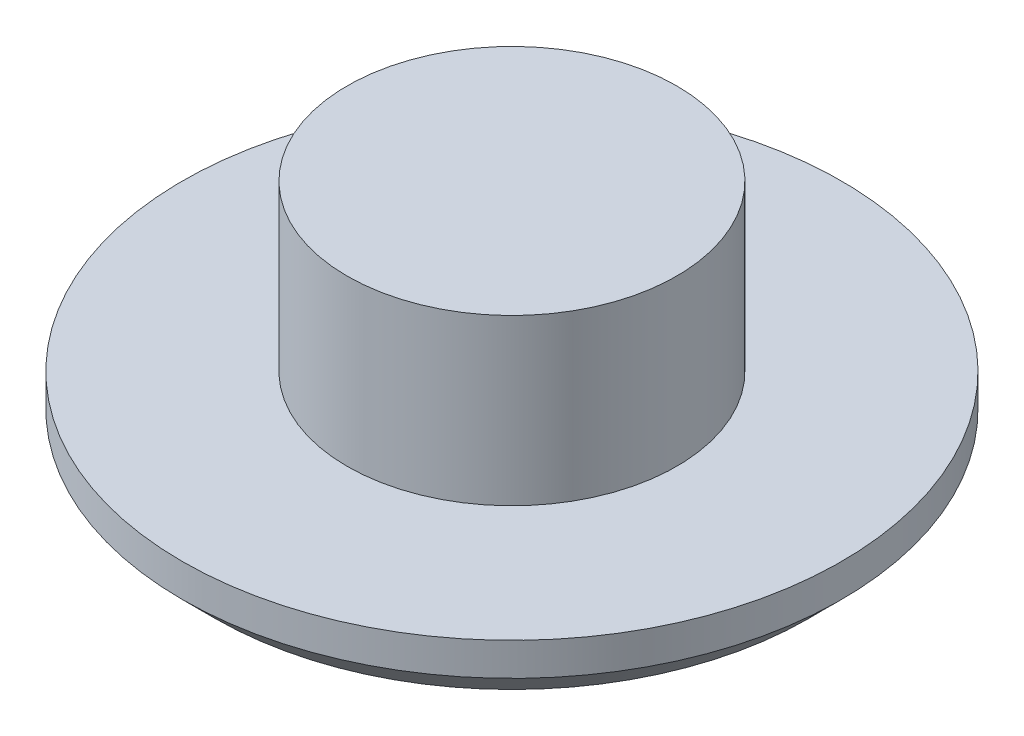
ISO-10303-21;
HEADER;
FILE_DESCRIPTION(('STEP AP214'),'2;1');
FILE_NAME('part.step','',(''),(''),'','','');
FILE_SCHEMA(('AUTOMOTIVE_DESIGN { 1 0 10303 214 1 1 1 1 }'));
ENDSEC;
DATA;
#1=APPLICATION_CONTEXT('core data for automotive mechanical design processes');
#2=APPLICATION_PROTOCOL_DEFINITION('international standard','automotive_design',2000,#1);
#3=PRODUCT_CONTEXT('',#1,'mechanical');
#4=PRODUCT('Part','Part','',(#3));
#5=PRODUCT_RELATED_PRODUCT_CATEGORY('part','',(#4));
#6=PRODUCT_DEFINITION_FORMATION('','',#4);
#7=PRODUCT_DEFINITION_CONTEXT('part definition',#1,'design');
#8=PRODUCT_DEFINITION('design','',#6,#7);
#9=PRODUCT_DEFINITION_SHAPE('','',#8);
#10=(LENGTH_UNIT() NAMED_UNIT(*) SI_UNIT(.MILLI.,.METRE.));
#11=(NAMED_UNIT(*) PLANE_ANGLE_UNIT() SI_UNIT($,.RADIAN.));
#12=(NAMED_UNIT(*) SI_UNIT($,.STERADIAN.) SOLID_ANGLE_UNIT());
#13=UNCERTAINTY_MEASURE_WITH_UNIT(LENGTH_MEASURE(1.E-05),#10,'distance_accuracy_value','');
#14=(GEOMETRIC_REPRESENTATION_CONTEXT(3) GLOBAL_UNCERTAINTY_ASSIGNED_CONTEXT((#13)) GLOBAL_UNIT_ASSIGNED_CONTEXT((#10,
#11,#12)) REPRESENTATION_CONTEXT('',''));
#15=CARTESIAN_POINT('',(0.,0.,0.));
#16=DIRECTION('',(0.,0.,1.));
#17=DIRECTION('',(1.,0.,0.));
#18=AXIS2_PLACEMENT_3D('',#15,#16,#17);
#19=CARTESIAN_POINT('',(0.,2.54,0.));
#20=DIRECTION('',(0.,-1.,0.));
#21=DIRECTION('',(0.,0.,-1.));
#22=AXIS2_PLACEMENT_3D('',#19,#20,#21);
#23=CYLINDRICAL_SURFACE('',#22,12.7);
#24=CARTESIAN_POINT('',(0.,1.27,0.));
#25=DIRECTION('',(0.,1.,0.));
#26=DIRECTION('',(0.,0.,1.));
#27=AXIS2_PLACEMENT_3D('',#24,#25,#26);
#28=CIRCLE('',#27,12.7);
#29=CARTESIAN_POINT('',(0.,1.27,12.7));
#30=VERTEX_POINT('',#29);
#31=EDGE_CURVE('E43',#30,#30,#28,.T.);
#32=ORIENTED_EDGE('',*,*,#31,.T.);
#33=EDGE_LOOP('',(#32));
#34=FACE_BOUND('',#33,.T.);
#35=CARTESIAN_POINT('',(0.,2.54,0.));
#36=DIRECTION('',(0.,1.,0.));
#37=DIRECTION('',(0.,0.,1.));
#38=AXIS2_PLACEMENT_3D('',#35,#36,#37);
#39=CIRCLE('',#38,12.7);
#40=CARTESIAN_POINT('',(0.,2.54,12.7));
#41=VERTEX_POINT('',#40);
#42=EDGE_CURVE('E51',#41,#41,#39,.T.);
#43=ORIENTED_EDGE('',*,*,#42,.F.);
#44=EDGE_LOOP('',(#43));
#45=FACE_BOUND('',#44,.T.);
#46=ADVANCED_FACE('F35',(#34,#45),#23,.T.);
#47=CARTESIAN_POINT('',(0.,2.54,0.));
#48=DIRECTION('',(0.,1.,0.));
#49=DIRECTION('',(0.,0.,1.));
#50=AXIS2_PLACEMENT_3D('',#47,#48,#49);
#51=PLANE('',#50);
#52=CARTESIAN_POINT('',(0.,2.54,0.));
#53=DIRECTION('',(0.,1.,0.));
#54=DIRECTION('',(0.,0.,1.));
#55=AXIS2_PLACEMENT_3D('',#52,#53,#54);
#56=CIRCLE('',#55,6.35);
#57=CARTESIAN_POINT('',(0.,2.54,6.35));
#58=VERTEX_POINT('',#57);
#59=EDGE_CURVE('E47',#58,#58,#56,.T.);
#60=ORIENTED_EDGE('',*,*,#59,.F.);
#61=EDGE_LOOP('',(#60));
#62=FACE_BOUND('',#61,.T.);
#63=ORIENTED_EDGE('',*,*,#42,.T.);
#64=EDGE_LOOP('',(#63));
#65=FACE_BOUND('',#64,.T.);
#66=ADVANCED_FACE('F69',(#62,#65),#51,.T.);
#67=CARTESIAN_POINT('',(0.,0.,0.));
#68=DIRECTION('',(0.,1.,0.));
#69=DIRECTION('',(0.,0.,1.));
#70=AXIS2_PLACEMENT_3D('',#67,#68,#69);
#71=PLANE('',#70);
#72=CARTESIAN_POINT('',(0.,0.,0.));
#73=DIRECTION('',(0.,1.,0.));
#74=DIRECTION('',(0.,0.,1.));
#75=AXIS2_PLACEMENT_3D('',#72,#73,#74);
#76=CIRCLE('',#75,11.43);
#77=CARTESIAN_POINT('',(0.,0.,11.43));
#78=VERTEX_POINT('',#77);
#79=EDGE_CURVE('E10',#78,#78,#76,.F.);
#80=ORIENTED_EDGE('',*,*,#79,.T.);
#81=EDGE_LOOP('',(#80));
#82=FACE_BOUND('',#81,.T.);
#83=ADVANCED_FACE('F65',(#82),#71,.F.);
#84=CARTESIAN_POINT('',(0.,8.89,0.));
#85=DIRECTION('',(0.,-1.,0.));
#86=DIRECTION('',(0.,0.,-1.));
#87=AXIS2_PLACEMENT_3D('',#84,#85,#86);
#88=CYLINDRICAL_SURFACE('',#87,6.35);
#89=CARTESIAN_POINT('',(0.,8.89,0.));
#90=DIRECTION('',(0.,1.,0.));
#91=DIRECTION('',(0.,0.,1.));
#92=AXIS2_PLACEMENT_3D('',#89,#90,#91);
#93=CIRCLE('',#92,6.35);
#94=CARTESIAN_POINT('',(0.,8.89,6.35));
#95=VERTEX_POINT('',#94);
#96=EDGE_CURVE('E55',#95,#95,#93,.T.);
#97=ORIENTED_EDGE('',*,*,#96,.F.);
#98=EDGE_LOOP('',(#97));
#99=FACE_BOUND('',#98,.T.);
#100=ORIENTED_EDGE('',*,*,#59,.T.);
#101=EDGE_LOOP('',(#100));
#102=FACE_BOUND('',#101,.T.);
#103=ADVANCED_FACE('F62',(#99,#102),#88,.T.);
#104=CARTESIAN_POINT('',(0.,8.89,0.));
#105=DIRECTION('',(0.,1.,0.));
#106=DIRECTION('',(0.,0.,1.));
#107=AXIS2_PLACEMENT_3D('',#104,#105,#106);
#108=PLANE('',#107);
#109=ORIENTED_EDGE('',*,*,#96,.T.);
#110=EDGE_LOOP('',(#109));
#111=FACE_BOUND('',#110,.T.);
#112=ADVANCED_FACE('F60',(#111),#108,.T.);
#113=CARTESIAN_POINT('',(0.,1.27,0.));
#114=DIRECTION('',(0.,1.,0.));
#115=DIRECTION('',(0.,0.,1.));
#116=AXIS2_PLACEMENT_3D('',#113,#114,#115);
#117=CONICAL_SURFACE('',#116,12.7,0.78539816339745);
#118=ORIENTED_EDGE('',*,*,#79,.F.);
#119=EDGE_LOOP('',(#118));
#120=FACE_BOUND('',#119,.T.);
#121=ORIENTED_EDGE('',*,*,#31,.F.);
#122=EDGE_LOOP('',(#121));
#123=FACE_BOUND('',#122,.T.);
#124=ADVANCED_FACE('F38',(#120,#123),#117,.T.);
#125=CLOSED_SHELL('',(#46,#66,#83,#103,#112,#124));
#126=MANIFOLD_SOLID_BREP('B2',#125);
#127=ADVANCED_BREP_SHAPE_REPRESENTATION('',(#18,#126),#14);
#128=SHAPE_DEFINITION_REPRESENTATION(#9,#127);
ENDSEC;
END-ISO-10303-21;
